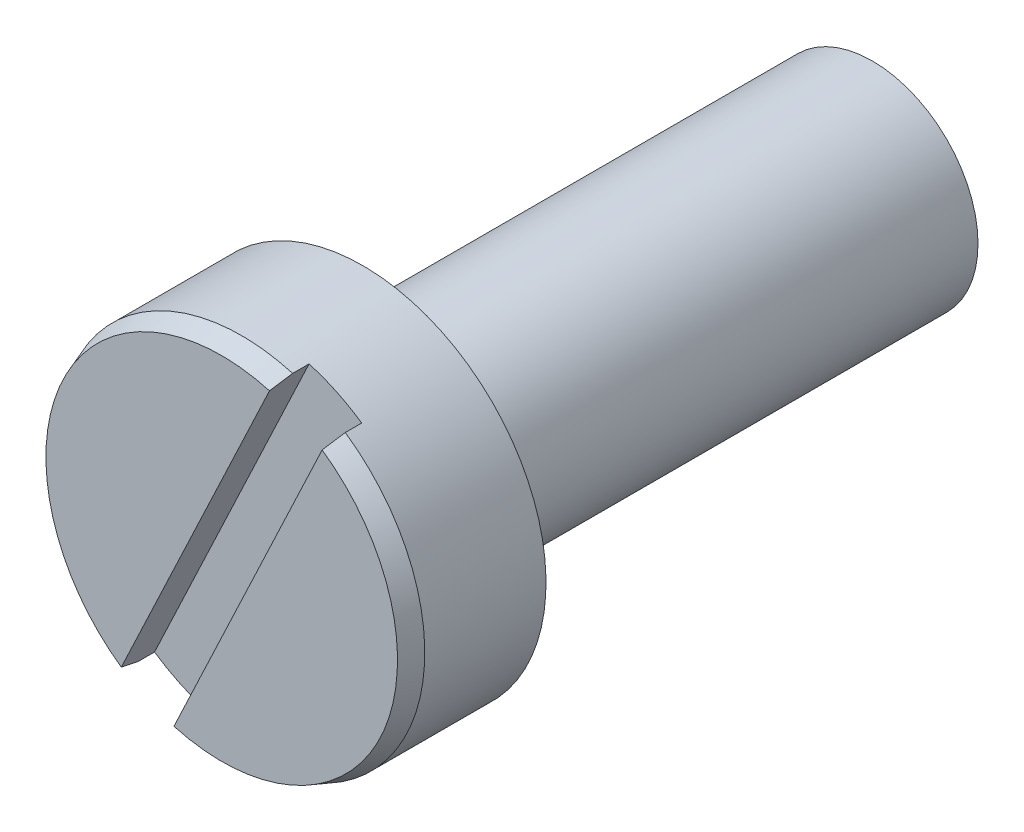
ISO-10303-21;
HEADER;
FILE_DESCRIPTION(('STEP AP214'),'2;1');
FILE_NAME('part.step','',(''),(''),'','','');
FILE_SCHEMA(('AUTOMOTIVE_DESIGN { 1 0 10303 214 1 1 1 1 }'));
ENDSEC;
DATA;
#1=APPLICATION_CONTEXT('core data for automotive mechanical design processes');
#2=APPLICATION_PROTOCOL_DEFINITION('international standard','automotive_design',2000,#1);
#3=PRODUCT_CONTEXT('',#1,'mechanical');
#4=PRODUCT('Part','Part','',(#3));
#5=PRODUCT_RELATED_PRODUCT_CATEGORY('part','',(#4));
#6=PRODUCT_DEFINITION_FORMATION('','',#4);
#7=PRODUCT_DEFINITION_CONTEXT('part definition',#1,'design');
#8=PRODUCT_DEFINITION('design','',#6,#7);
#9=PRODUCT_DEFINITION_SHAPE('','',#8);
#10=(LENGTH_UNIT() NAMED_UNIT(*) SI_UNIT(.MILLI.,.METRE.));
#11=(NAMED_UNIT(*) PLANE_ANGLE_UNIT() SI_UNIT($,.RADIAN.));
#12=(NAMED_UNIT(*) SI_UNIT($,.STERADIAN.) SOLID_ANGLE_UNIT());
#13=UNCERTAINTY_MEASURE_WITH_UNIT(LENGTH_MEASURE(1.E-05),#10,'distance_accuracy_value','');
#14=(GEOMETRIC_REPRESENTATION_CONTEXT(3) GLOBAL_UNCERTAINTY_ASSIGNED_CONTEXT((#13)) GLOBAL_UNIT_ASSIGNED_CONTEXT((#10,
#11,#12)) REPRESENTATION_CONTEXT('',''));
#15=CARTESIAN_POINT('',(0.,0.,0.));
#16=DIRECTION('',(0.,0.,1.));
#17=DIRECTION('',(1.,0.,0.));
#18=AXIS2_PLACEMENT_3D('',#15,#16,#17);
#19=CARTESIAN_POINT('',(-15.2278019032069,-23.3190317123695,19.8));
#20=DIRECTION('',(0.,0.,-1.));
#21=DIRECTION('',(0.427457329703379,0.904035525453982,0.));
#22=AXIS2_PLACEMENT_3D('',#19,#20,#21);
#23=TOROIDAL_SURFACE('',#22,1.95,0.5);
#24=CARTESIAN_POINT('',(-15.2278019032069,-23.3190317123695,19.8));
#25=DIRECTION('',(0.,0.,-1.));
#26=DIRECTION('',(0.427457329703379,0.904035525453982,0.));
#27=AXIS2_PLACEMENT_3D('',#24,#25,#26);
#28=CIRCLE('',#27,1.45);
#29=CARTESIAN_POINT('',(-14.607988775137,-22.0081802004612,19.8));
#30=VERTEX_POINT('',#29);
#31=EDGE_CURVE('E11',#30,#30,#28,.T.);
#32=ORIENTED_EDGE('',*,*,#31,.F.);
#33=EDGE_LOOP('',(#32));
#34=FACE_BOUND('',#33,.T.);
#35=CARTESIAN_POINT('',(-15.2278019032069,-23.3190317123688,20.3));
#36=DIRECTION('',(0.,0.,1.));
#37=DIRECTION('',(0.427457329703379,0.904035525453982,0.));
#38=AXIS2_PLACEMENT_3D('',#35,#36,#37);
#39=CIRCLE('',#38,1.95);
#40=CARTESIAN_POINT('',(-14.3942601102853,-21.5561624377335,20.3));
#41=VERTEX_POINT('',#40);
#42=EDGE_CURVE('E125',#41,#41,#39,.T.);
#43=ORIENTED_EDGE('',*,*,#42,.F.);
#44=EDGE_LOOP('',(#43));
#45=FACE_BOUND('',#44,.T.);
#46=ADVANCED_FACE('F17',(#34,#45),#23,.F.);
#47=CARTESIAN_POINT('',(-15.2278019032069,-23.3190317123687,13.3));
#48=DIRECTION('',(0.,0.,1.));
#49=DIRECTION('',(-0.427457329703379,-0.904035525453982,0.));
#50=AXIS2_PLACEMENT_3D('',#47,#48,#49);
#51=CONICAL_SURFACE('',#50,1.175252258055,1.221730476396);
#52=CARTESIAN_POINT('',(-15.2278019032069,-23.3190317123687,13.3));
#53=DIRECTION('',(0.,0.,-1.));
#54=DIRECTION('',(0.427457329703379,0.904035525453982,0.));
#55=AXIS2_PLACEMENT_3D('',#52,#53,#54);
#56=CIRCLE('',#55,1.175252258055);
#57=CARTESIAN_POINT('',(-14.7254317112508,-22.2565619197169,13.3));
#58=VERTEX_POINT('',#57);
#59=EDGE_CURVE('E110',#58,#58,#56,.T.);
#60=ORIENTED_EDGE('',*,*,#59,.F.);
#61=EDGE_LOOP('',(#60));
#62=FACE_BOUND('',#61,.T.);
#63=CARTESIAN_POINT('',(-15.2278019032069,-23.3190317123685,13.4));
#64=DIRECTION('',(0.,0.,1.));
#65=DIRECTION('',(0.427457329703379,0.904035525453982,0.));
#66=AXIS2_PLACEMENT_3D('',#63,#64,#65);
#67=CIRCLE('',#66,1.45);
#68=CARTESIAN_POINT('',(-14.607988775137,-22.0081802004602,13.4));
#69=VERTEX_POINT('',#68);
#70=EDGE_CURVE('E26',#69,#69,#67,.T.);
#71=ORIENTED_EDGE('',*,*,#70,.F.);
#72=EDGE_LOOP('',(#71));
#73=FACE_BOUND('',#72,.T.);
#74=ADVANCED_FACE('F181',(#62,#73),#51,.T.);
#75=CARTESIAN_POINT('',(-15.2278019032069,-23.3190317123688,20.3));
#76=DIRECTION('',(0.,0.,1.));
#77=DIRECTION('',(-0.427457329703379,-0.904035525453982,0.));
#78=AXIS2_PLACEMENT_3D('',#75,#76,#77);
#79=CONICAL_SURFACE('',#78,2.240252258055,1.221730476396);
#80=CARTESIAN_POINT('',(-15.2278019032069,-23.3190317123688,20.3));
#81=DIRECTION('',(0.,0.,-1.));
#82=DIRECTION('',(0.427457329703379,0.904035525453982,0.));
#83=AXIS2_PLACEMENT_3D('',#80,#81,#82);
#84=CIRCLE('',#83,2.240252258055);
#85=CARTESIAN_POINT('',(-14.2701896551167,-21.2937640851086,20.3));
#86=VERTEX_POINT('',#85);
#87=EDGE_CURVE('E121',#86,#86,#84,.T.);
#88=ORIENTED_EDGE('',*,*,#87,.F.);
#89=EDGE_LOOP('',(#88));
#90=FACE_BOUND('',#89,.T.);
#91=CARTESIAN_POINT('',(-15.2278019032069,-23.3190317123687,20.4));
#92=DIRECTION('',(0.,0.,1.));
#93=DIRECTION('',(0.427457329703379,0.904035525453982,0.));
#94=AXIS2_PLACEMENT_3D('',#91,#92,#93);
#95=CIRCLE('',#94,2.515);
#96=CARTESIAN_POINT('',(-14.1527467190029,-21.0453823658519,20.4));
#97=VERTEX_POINT('',#96);
#98=EDGE_CURVE('E68',#97,#97,#95,.T.);
#99=ORIENTED_EDGE('',*,*,#98,.F.);
#100=EDGE_LOOP('',(#99));
#101=FACE_BOUND('',#100,.T.);
#102=ADVANCED_FACE('F186',(#90,#101),#79,.T.);
#103=CARTESIAN_POINT('',(-15.2278019032069,-23.3190317123687,13.3));
#104=DIRECTION('',(0.,0.,-1.));
#105=DIRECTION('',(0.427457329703379,0.904035525453982,0.));
#106=AXIS2_PLACEMENT_3D('',#103,#104,#105);
#107=CYLINDRICAL_SURFACE('',#106,1.45);
#108=ORIENTED_EDGE('',*,*,#31,.T.);
#109=EDGE_LOOP('',(#108));
#110=FACE_BOUND('',#109,.T.);
#111=ORIENTED_EDGE('',*,*,#70,.T.);
#112=EDGE_LOOP('',(#111));
#113=FACE_BOUND('',#112,.T.);
#114=ADVANCED_FACE('F174',(#110,#113),#107,.T.);
#115=CARTESIAN_POINT('',(-15.2278019032069,-23.3190317123687,13.3));
#116=DIRECTION('',(0.,0.,-1.));
#117=DIRECTION('',(0.427457329703379,0.904035525453982,0.));
#118=AXIS2_PLACEMENT_3D('',#115,#116,#117);
#119=CYLINDRICAL_SURFACE('',#118,2.515);
#120=CARTESIAN_POINT('',(-15.2278019032069,-23.3190317123693,21.84));
#121=DIRECTION('',(0.,0.,-1.));
#122=DIRECTION('',(-0.427457329703369,-0.904035525453986,0.));
#123=AXIS2_PLACEMENT_3D('',#120,#121,#122);
#124=CIRCLE('',#123,2.515);
#125=CARTESIAN_POINT('',(-15.9275587337508,-25.7347232030419,21.84));
#126=VERTEX_POINT('',#125);
#127=CARTESIAN_POINT('',(-16.6507871541138,-25.3927573392792,21.84));
#128=VERTEX_POINT('',#127);
#129=EDGE_CURVE('E145',#126,#128,#124,.T.);
#130=ORIENTED_EDGE('',*,*,#129,.T.);
#131=DIRECTION('',(0.,0.,-1.));
#132=VECTOR('',#131,1.);
#133=CARTESIAN_POINT('',(-16.6507871541138,-25.3927573392792,13.3));
#134=LINE('',#133,#132);
#135=CARTESIAN_POINT('',(-16.6507871541138,-25.3927573392792,22.0652522580551));
#136=VERTEX_POINT('',#135);
#137=EDGE_CURVE('E64',#136,#128,#134,.T.);
#138=ORIENTED_EDGE('',*,*,#137,.F.);
#139=CARTESIAN_POINT('',(-15.2278019032069,-23.3190317123691,22.0652522580551));
#140=DIRECTION('',(0.,0.,-1.));
#141=DIRECTION('',(-0.427457329703379,-0.904035525453982,0.));
#142=AXIS2_PLACEMENT_3D('',#139,#140,#141);
#143=CIRCLE('',#142,2.515);
#144=CARTESIAN_POINT('',(-14.5280450726638,-20.9033402216962,22.0652522580551));
#145=VERTEX_POINT('',#144);
#146=EDGE_CURVE('E53',#136,#145,#143,.T.);
#147=ORIENTED_EDGE('',*,*,#146,.T.);
#148=DIRECTION('',(0.,0.,1.));
#149=VECTOR('',#148,1.);
#150=CARTESIAN_POINT('',(-14.5280450726638,-20.9033402216957,13.3000000000001));
#151=LINE('',#150,#149);
#152=CARTESIAN_POINT('',(-14.5280450726638,-20.9033402216963,21.84));
#153=VERTEX_POINT('',#152);
#154=EDGE_CURVE('E61',#153,#145,#151,.T.);
#155=ORIENTED_EDGE('',*,*,#154,.F.);
#156=CARTESIAN_POINT('',(-15.2278019032069,-23.3190317123693,21.84));
#157=DIRECTION('',(0.,0.,-1.));
#158=DIRECTION('',(-0.427457329703379,-0.904035525453982,0.));
#159=AXIS2_PLACEMENT_3D('',#156,#157,#158);
#160=CIRCLE('',#159,2.515);
#161=CARTESIAN_POINT('',(-13.8048166523008,-21.2453060854593,21.84));
#162=VERTEX_POINT('',#161);
#163=EDGE_CURVE('E93',#153,#162,#160,.T.);
#164=ORIENTED_EDGE('',*,*,#163,.T.);
#165=DIRECTION('',(0.,0.,-1.));
#166=VECTOR('',#165,1.);
#167=CARTESIAN_POINT('',(-13.8048166523008,-21.2453060854586,13.3000000000001));
#168=LINE('',#167,#166);
#169=CARTESIAN_POINT('',(-13.8048166523008,-21.2453060854592,22.0652522580551));
#170=VERTEX_POINT('',#169);
#171=EDGE_CURVE('E96',#170,#162,#168,.T.);
#172=ORIENTED_EDGE('',*,*,#171,.F.);
#173=CARTESIAN_POINT('',(-15.9275587337508,-25.7347232030419,22.0652522580551));
#174=VERTEX_POINT('',#173);
#175=EDGE_CURVE('E106',#170,#174,#143,.T.);
#176=ORIENTED_EDGE('',*,*,#175,.T.);
#177=DIRECTION('',(0.,0.,1.));
#178=VECTOR('',#177,1.);
#179=CARTESIAN_POINT('',(-15.9275587337508,-25.7347232030419,13.3));
#180=LINE('',#179,#178);
#181=EDGE_CURVE('E103',#126,#174,#180,.T.);
#182=ORIENTED_EDGE('',*,*,#181,.F.);
#183=EDGE_LOOP('',(#130,#138,#147,#155,#164,#172,#176,#182));
#184=FACE_BOUND('',#183,.T.);
#185=ORIENTED_EDGE('',*,*,#98,.T.);
#186=EDGE_LOOP('',(#185));
#187=FACE_BOUND('',#186,.T.);
#188=ADVANCED_FACE('F56',(#184,#187),#119,.T.);
#189=CARTESIAN_POINT('',(-15.2278019032069,-23.3190317123685,22.34));
#190=DIRECTION('',(0.,0.,1.));
#191=DIRECTION('',(-0.427457329703379,-0.904035525453982,0.));
#192=AXIS2_PLACEMENT_3D('',#189,#190,#191);
#193=PLANE('',#192);
#194=DIRECTION('',(-0.427457329703379,-0.904035525453982,0.));
#195=VECTOR('',#194,1.);
#196=CARTESIAN_POINT('',(-16.8872657778918,-25.8928893104734,22.34));
#197=LINE('',#196,#195);
#198=CARTESIAN_POINT('',(-14.5713652108738,-20.9949585919706,22.34));
#199=VERTEX_POINT('',#198);
#200=CARTESIAN_POINT('',(-16.6074670159038,-25.3011389690046,22.34));
#201=VERTEX_POINT('',#200);
#202=EDGE_CURVE('E76',#199,#201,#197,.T.);
#203=ORIENTED_EDGE('',*,*,#202,.F.);
#204=CARTESIAN_POINT('',(-15.2278019032069,-23.3190317123685,22.34));
#205=DIRECTION('',(0.,0.,1.));
#206=DIRECTION('',(-0.427457329703379,-0.904035525453982,0.));
#207=AXIS2_PLACEMENT_3D('',#204,#205,#206);
#208=CIRCLE('',#207,2.415);
#209=EDGE_CURVE('E36',#199,#201,#208,.T.);
#210=ORIENTED_EDGE('',*,*,#209,.T.);
#211=EDGE_LOOP('',(#203,#210));
#212=FACE_BOUND('',#211,.T.);
#213=ADVANCED_FACE('F163',(#212),#193,.T.);
#214=CARTESIAN_POINT('',(-15.2278019032069,-23.3190317123691,22.0652522580551));
#215=DIRECTION('',(0.,0.,-1.));
#216=DIRECTION('',(0.427457329703379,0.904035525453982,0.));
#217=AXIS2_PLACEMENT_3D('',#214,#215,#216);
#218=CONICAL_SURFACE('',#217,2.515,0.349065850399);
#219=CARTESIAN_POINT('',(312.017732713186,669.712923176622,-261.393080578831));
#220=DIRECTION('',(0.904035525452299,-0.427457329706938,1.46077674032882E-12));
#221=DIRECTION('',(-0.401017918661995,-0.848118442749434,0.346236531839547));
#222=AXIS2_PLACEMENT_3D('',#219,#220,#221);
#223=CIRCLE('',#222,819.477595478914);
#224=EDGE_CURVE('E153',#201,#136,#223,.T.);
#225=ORIENTED_EDGE('',*,*,#224,.F.);
#226=ORIENTED_EDGE('',*,*,#209,.F.);
#227=CARTESIAN_POINT('',(-343.196562303542,-716.009015169843,-261.3930783065));
#228=DIRECTION('',(0.904035525453982,-0.427457329703379,0.));
#229=DIRECTION('',(0.401070781773213,0.848230243697522,0.345901260021795));
#230=AXIS2_PLACEMENT_3D('',#227,#228,#229);
#231=CIRCLE('',#230,819.477588912782);
#232=EDGE_CURVE('E71',#145,#199,#231,.T.);
#233=ORIENTED_EDGE('',*,*,#232,.F.);
#234=ORIENTED_EDGE('',*,*,#146,.F.);
#235=EDGE_LOOP('',(#225,#226,#233,#234));
#236=FACE_BOUND('',#235,.T.);
#237=ADVANCED_FACE('F72',(#236),#218,.T.);
#238=DIRECTION('',(0.427457329703379,0.904035525453982,0.));
#239=VECTOR('',#238,1.);
#240=CARTESIAN_POINT('',(-16.1640373575288,-26.2348551742361,22.34));
#241=LINE('',#240,#239);
#242=CARTESIAN_POINT('',(-15.8842385955408,-25.6431048327674,22.34));
#243=VERTEX_POINT('',#242);
#244=CARTESIAN_POINT('',(-13.8481367905108,-21.3369244557335,22.3400000000002));
#245=VERTEX_POINT('',#244);
#246=EDGE_CURVE('E246',#243,#245,#241,.T.);
#247=ORIENTED_EDGE('',*,*,#246,.F.);
#248=EDGE_CURVE('E111',#243,#245,#208,.T.);
#249=ORIENTED_EDGE('',*,*,#248,.T.);
#250=EDGE_LOOP('',(#247,#249));
#251=FACE_BOUND('',#250,.T.);
#252=ADVANCED_FACE('F166',(#251),#193,.T.);
#253=CARTESIAN_POINT('',(-12.9541525566908,-24.3940868965728,20.3));
#254=DIRECTION('',(0.,0.,-1.));
#255=DIRECTION('',(0.427457329703379,0.904035525453982,0.));
#256=AXIS2_PLACEMENT_3D('',#253,#254,#255);
#257=PLANE('',#256);
#258=ORIENTED_EDGE('',*,*,#42,.T.);
#259=EDGE_LOOP('',(#258));
#260=FACE_BOUND('',#259,.T.);
#261=ORIENTED_EDGE('',*,*,#87,.T.);
#262=EDGE_LOOP('',(#261));
#263=FACE_BOUND('',#262,.T.);
#264=ADVANCED_FACE('F178',(#260,#263),#257,.T.);
#265=CARTESIAN_POINT('',(-13.9169503912988,-23.9388448404386,13.3));
#266=DIRECTION('',(0.,0.,-1.));
#267=DIRECTION('',(0.427457329703379,0.904035525453982,0.));
#268=AXIS2_PLACEMENT_3D('',#265,#266,#267);
#269=PLANE('',#268);
#270=ORIENTED_EDGE('',*,*,#59,.T.);
#271=EDGE_LOOP('',(#270));
#272=FACE_BOUND('',#271,.T.);
#273=ADVANCED_FACE('F208',(#272),#269,.T.);
#274=CARTESIAN_POINT('',(-342.473336519594,-716.350986601355,-261.393080578849));
#275=DIRECTION('',(-0.904035525452299,0.427457329706938,1.44341947337369E-12));
#276=DIRECTION('',(0.401017918661986,0.848118442749428,0.346236531839572));
#277=AXIS2_PLACEMENT_3D('',#274,#275,#276);
#278=CIRCLE('',#277,819.477595478914);
#279=EDGE_CURVE('E86',#245,#170,#278,.T.);
#280=ORIENTED_EDGE('',*,*,#279,.F.);
#281=ORIENTED_EDGE('',*,*,#248,.F.);
#282=CARTESIAN_POINT('',(312.740958497134,669.37095174511,-261.39307830648));
#283=DIRECTION('',(-0.904035525453982,0.427457329703379,0.));
#284=DIRECTION('',(-0.401070781773222,-0.848230243697527,0.345901260021773));
#285=AXIS2_PLACEMENT_3D('',#282,#283,#284);
#286=CIRCLE('',#285,819.477588912782);
#287=EDGE_CURVE('E115',#174,#243,#286,.T.);
#288=ORIENTED_EDGE('',*,*,#287,.F.);
#289=ORIENTED_EDGE('',*,*,#175,.F.);
#290=EDGE_LOOP('',(#280,#281,#288,#289));
#291=FACE_BOUND('',#290,.T.);
#292=ADVANCED_FACE('F173',(#291),#218,.T.);
#293=CARTESIAN_POINT('',(-16.8872657778918,-25.8928893104734,21.84));
#294=DIRECTION('',(-0.904035525453982,0.427457329703379,0.));
#295=DIRECTION('',(-0.427457329703379,-0.904035525453982,0.));
#296=AXIS2_PLACEMENT_3D('',#293,#294,#295);
#297=PLANE('',#296);
#298=ORIENTED_EDGE('',*,*,#137,.T.);
#299=DIRECTION('',(-0.427457329703379,-0.904035525453982,0.));
#300=VECTOR('',#299,1.);
#301=CARTESIAN_POINT('',(-16.8872657778918,-25.8928893104734,21.84));
#302=LINE('',#301,#300);
#303=EDGE_CURVE('E81',#153,#128,#302,.T.);
#304=ORIENTED_EDGE('',*,*,#303,.F.);
#305=ORIENTED_EDGE('',*,*,#154,.T.);
#306=ORIENTED_EDGE('',*,*,#232,.T.);
#307=ORIENTED_EDGE('',*,*,#202,.T.);
#308=ORIENTED_EDGE('',*,*,#224,.T.);
#309=EDGE_LOOP('',(#298,#304,#305,#306,#307,#308));
#310=FACE_BOUND('',#309,.T.);
#311=ADVANCED_FACE('F79',(#310),#297,.F.);
#312=CARTESIAN_POINT('',(-16.1640373575288,-26.2348551742361,21.84));
#313=DIRECTION('',(0.904035525453982,-0.427457329703379,0.));
#314=DIRECTION('',(0.427457329703379,0.904035525453982,0.));
#315=AXIS2_PLACEMENT_3D('',#312,#313,#314);
#316=PLANE('',#315);
#317=ORIENTED_EDGE('',*,*,#171,.T.);
#318=DIRECTION('',(0.427457329703379,0.904035525453982,0.));
#319=VECTOR('',#318,1.);
#320=CARTESIAN_POINT('',(-16.1640373575288,-26.2348551742361,21.84));
#321=LINE('',#320,#319);
#322=EDGE_CURVE('E97',#126,#162,#321,.T.);
#323=ORIENTED_EDGE('',*,*,#322,.F.);
#324=ORIENTED_EDGE('',*,*,#181,.T.);
#325=ORIENTED_EDGE('',*,*,#287,.T.);
#326=ORIENTED_EDGE('',*,*,#246,.T.);
#327=ORIENTED_EDGE('',*,*,#279,.T.);
#328=EDGE_LOOP('',(#317,#323,#324,#325,#326,#327));
#329=FACE_BOUND('',#328,.T.);
#330=ADVANCED_FACE('F217',(#329),#316,.F.);
#331=CARTESIAN_POINT('',(-15.2278019032069,-23.3190317123693,21.84));
#332=DIRECTION('',(0.,0.,1.));
#333=DIRECTION('',(-0.427457329703379,-0.904035525453982,0.));
#334=AXIS2_PLACEMENT_3D('',#331,#332,#333);
#335=PLANE('',#334);
#336=ORIENTED_EDGE('',*,*,#303,.T.);
#337=ORIENTED_EDGE('',*,*,#129,.F.);
#338=ORIENTED_EDGE('',*,*,#322,.T.);
#339=ORIENTED_EDGE('',*,*,#163,.F.);
#340=EDGE_LOOP('',(#336,#337,#338,#339));
#341=FACE_BOUND('',#340,.T.);
#342=ADVANCED_FACE('F220',(#341),#335,.T.);
#343=CLOSED_SHELL('',(#46,#74,#102,#114,#188,#213,#237,#252,#264,#273,#292,#311,#330,#342));
#344=MANIFOLD_SOLID_BREP('B1',#343);
#345=ADVANCED_BREP_SHAPE_REPRESENTATION('',(#18,#344),#14);
#346=SHAPE_DEFINITION_REPRESENTATION(#9,#345);
ENDSEC;
END-ISO-10303-21;
